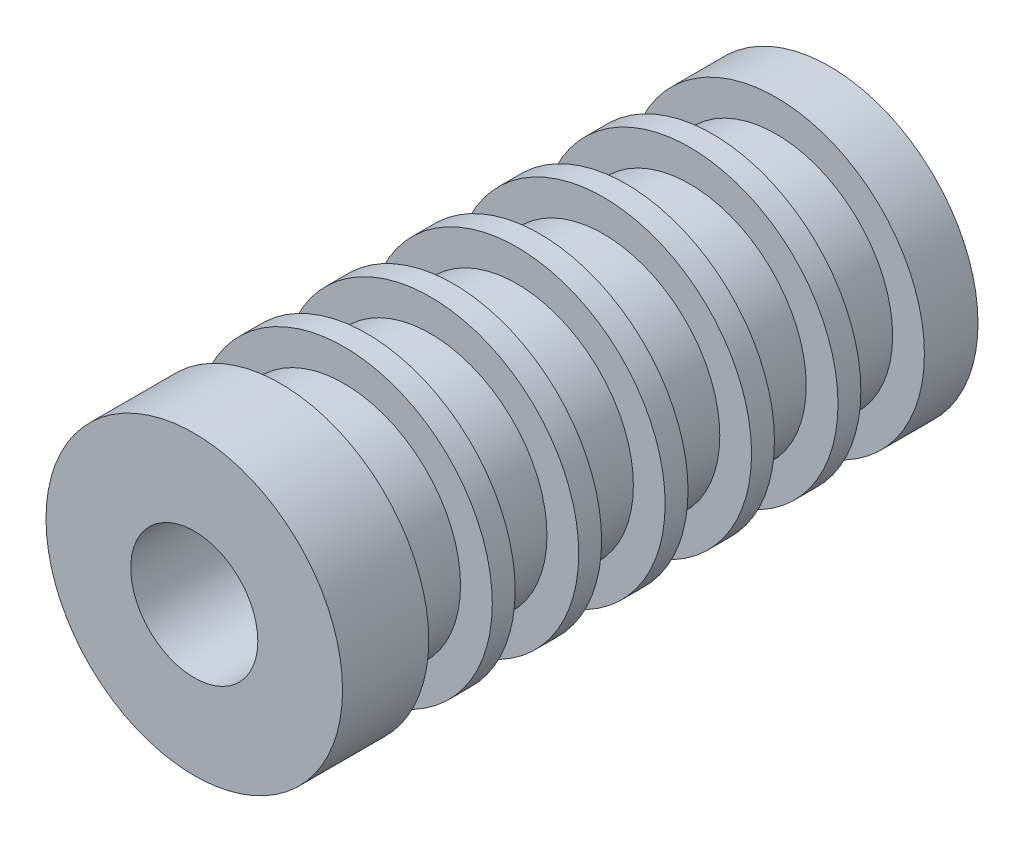
ISO-10303-21;
HEADER;
FILE_DESCRIPTION(('STEP AP214'),'2;1');
FILE_NAME('part.step','',(''),(''),'','','');
FILE_SCHEMA(('AUTOMOTIVE_DESIGN { 1 0 10303 214 1 1 1 1 }'));
ENDSEC;
DATA;
#1=APPLICATION_CONTEXT('core data for automotive mechanical design processes');
#2=APPLICATION_PROTOCOL_DEFINITION('international standard','automotive_design',2000,#1);
#3=PRODUCT_CONTEXT('',#1,'mechanical');
#4=PRODUCT('Part','Part','',(#3));
#5=PRODUCT_RELATED_PRODUCT_CATEGORY('part','',(#4));
#6=PRODUCT_DEFINITION_FORMATION('','',#4);
#7=PRODUCT_DEFINITION_CONTEXT('part definition',#1,'design');
#8=PRODUCT_DEFINITION('design','',#6,#7);
#9=PRODUCT_DEFINITION_SHAPE('','',#8);
#10=(LENGTH_UNIT() NAMED_UNIT(*) SI_UNIT(.MILLI.,.METRE.));
#11=(NAMED_UNIT(*) PLANE_ANGLE_UNIT() SI_UNIT($,.RADIAN.));
#12=(NAMED_UNIT(*) SI_UNIT($,.STERADIAN.) SOLID_ANGLE_UNIT());
#13=UNCERTAINTY_MEASURE_WITH_UNIT(LENGTH_MEASURE(1.E-05),#10,'distance_accuracy_value','');
#14=(GEOMETRIC_REPRESENTATION_CONTEXT(3) GLOBAL_UNCERTAINTY_ASSIGNED_CONTEXT((#13)) GLOBAL_UNIT_ASSIGNED_CONTEXT((#10,
#11,#12)) REPRESENTATION_CONTEXT('',''));
#15=CARTESIAN_POINT('',(0.,0.,0.));
#16=DIRECTION('',(0.,0.,1.));
#17=DIRECTION('',(1.,0.,0.));
#18=AXIS2_PLACEMENT_3D('',#15,#16,#17);
#19=CARTESIAN_POINT('',(0.,0.,25.4));
#20=DIRECTION('',(0.,0.,-1.));
#21=DIRECTION('',(-1.,0.,0.));
#22=AXIS2_PLACEMENT_3D('',#19,#20,#21);
#23=CYLINDRICAL_SURFACE('',#22,11.1125);
#24=CARTESIAN_POINT('',(0.,0.,22.225));
#25=DIRECTION('',(0.,0.,1.));
#26=DIRECTION('',(1.,0.,0.));
#27=AXIS2_PLACEMENT_3D('',#24,#25,#26);
#28=CIRCLE('',#27,11.1125);
#29=CARTESIAN_POINT('',(11.1125,0.,22.225));
#30=VERTEX_POINT('',#29);
#31=EDGE_CURVE('E39',#30,#30,#28,.T.);
#32=ORIENTED_EDGE('',*,*,#31,.F.);
#33=EDGE_LOOP('',(#32));
#34=FACE_BOUND('',#33,.T.);
#35=CARTESIAN_POINT('',(0.,0.,15.763875));
#36=DIRECTION('',(0.,0.,-1.));
#37=DIRECTION('',(-1.,0.,0.));
#38=AXIS2_PLACEMENT_3D('',#35,#36,#37);
#39=CIRCLE('',#38,11.1125);
#40=CARTESIAN_POINT('',(-11.1125,0.,15.763875));
#41=VERTEX_POINT('',#40);
#42=EDGE_CURVE('E68',#41,#41,#39,.T.);
#43=ORIENTED_EDGE('',*,*,#42,.F.);
#44=EDGE_LOOP('',(#43));
#45=FACE_BOUND('',#44,.T.);
#46=ADVANCED_FACE('F32',(#34,#45),#23,.T.);
#47=CARTESIAN_POINT('',(0.,0.,-14.906625));
#48=DIRECTION('',(0.,0.,-1.));
#49=DIRECTION('',(-1.,0.,0.));
#50=AXIS2_PLACEMENT_3D('',#47,#48,#49);
#51=CIRCLE('',#50,11.1125);
#52=CARTESIAN_POINT('',(-11.1125,0.,-14.906625));
#53=VERTEX_POINT('',#52);
#54=EDGE_CURVE('E114',#53,#53,#51,.T.);
#55=ORIENTED_EDGE('',*,*,#54,.T.);
#56=EDGE_LOOP('',(#55));
#57=FACE_BOUND('',#56,.T.);
#58=CARTESIAN_POINT('',(0.,0.,-16.621125));
#59=DIRECTION('',(0.,0.,-1.));
#60=DIRECTION('',(-1.,0.,0.));
#61=AXIS2_PLACEMENT_3D('',#58,#59,#60);
#62=CIRCLE('',#61,11.1125);
#63=CARTESIAN_POINT('',(-11.1125,0.,-16.621125));
#64=VERTEX_POINT('',#63);
#65=EDGE_CURVE('E51',#64,#64,#62,.T.);
#66=ORIENTED_EDGE('',*,*,#65,.F.);
#67=EDGE_LOOP('',(#66));
#68=FACE_BOUND('',#67,.T.);
#69=ADVANCED_FACE('F158',(#57,#68),#23,.T.);
#70=CARTESIAN_POINT('',(0.,0.,-21.383625));
#71=DIRECTION('',(0.,0.,-1.));
#72=DIRECTION('',(-1.,0.,0.));
#73=AXIS2_PLACEMENT_3D('',#70,#71,#72);
#74=CIRCLE('',#73,11.1125);
#75=CARTESIAN_POINT('',(-11.1125,0.,-21.383625));
#76=VERTEX_POINT('',#75);
#77=EDGE_CURVE('E53',#76,#76,#74,.T.);
#78=ORIENTED_EDGE('',*,*,#77,.T.);
#79=EDGE_LOOP('',(#78));
#80=FACE_BOUND('',#79,.T.);
#81=CARTESIAN_POINT('',(0.,0.,-25.4));
#82=DIRECTION('',(0.,0.,1.));
#83=DIRECTION('',(1.,0.,0.));
#84=AXIS2_PLACEMENT_3D('',#81,#82,#83);
#85=CIRCLE('',#84,11.1125);
#86=CARTESIAN_POINT('',(11.1125,0.,-25.4));
#87=VERTEX_POINT('',#86);
#88=EDGE_CURVE('E10',#87,#87,#85,.T.);
#89=ORIENTED_EDGE('',*,*,#88,.T.);
#90=EDGE_LOOP('',(#89));
#91=FACE_BOUND('',#90,.T.);
#92=ADVANCED_FACE('F34',(#80,#91),#23,.T.);
#93=CARTESIAN_POINT('',(0.,0.,-25.4));
#94=DIRECTION('',(0.,0.,1.));
#95=DIRECTION('',(1.,0.,0.));
#96=AXIS2_PLACEMENT_3D('',#93,#94,#95);
#97=PLANE('',#96);
#98=CARTESIAN_POINT('',(0.,0.,-25.4));
#99=DIRECTION('',(0.,0.,1.));
#100=DIRECTION('',(1.,0.,0.));
#101=AXIS2_PLACEMENT_3D('',#98,#99,#100);
#102=CIRCLE('',#101,4.7625);
#103=CARTESIAN_POINT('',(4.7625,0.,-25.4));
#104=VERTEX_POINT('',#103);
#105=EDGE_CURVE('E43',#104,#104,#102,.T.);
#106=ORIENTED_EDGE('',*,*,#105,.T.);
#107=EDGE_LOOP('',(#106));
#108=FACE_BOUND('',#107,.T.);
#109=ORIENTED_EDGE('',*,*,#88,.F.);
#110=EDGE_LOOP('',(#109));
#111=FACE_BOUND('',#110,.T.);
#112=ADVANCED_FACE('F157',(#108,#111),#97,.F.);
#113=CARTESIAN_POINT('',(0.,0.,22.225));
#114=DIRECTION('',(0.,0.,1.));
#115=DIRECTION('',(1.,0.,0.));
#116=AXIS2_PLACEMENT_3D('',#113,#114,#115);
#117=PLANE('',#116);
#118=CARTESIAN_POINT('',(0.,0.,22.225));
#119=DIRECTION('',(0.,0.,1.));
#120=DIRECTION('',(1.,0.,0.));
#121=AXIS2_PLACEMENT_3D('',#118,#119,#120);
#122=CIRCLE('',#121,4.7625);
#123=CARTESIAN_POINT('',(4.7625,0.,22.225));
#124=VERTEX_POINT('',#123);
#125=EDGE_CURVE('E47',#124,#124,#122,.T.);
#126=ORIENTED_EDGE('',*,*,#125,.F.);
#127=EDGE_LOOP('',(#126));
#128=FACE_BOUND('',#127,.T.);
#129=ORIENTED_EDGE('',*,*,#31,.T.);
#130=EDGE_LOOP('',(#129));
#131=FACE_BOUND('',#130,.T.);
#132=ADVANCED_FACE('F234',(#128,#131),#117,.T.);
#133=CARTESIAN_POINT('',(0.,0.,-25.4));
#134=DIRECTION('',(0.,0.,1.));
#135=DIRECTION('',(1.,0.,0.));
#136=AXIS2_PLACEMENT_3D('',#133,#134,#135);
#137=CYLINDRICAL_SURFACE('',#136,4.7625);
#138=ORIENTED_EDGE('',*,*,#105,.F.);
#139=EDGE_LOOP('',(#138));
#140=FACE_BOUND('',#139,.T.);
#141=ORIENTED_EDGE('',*,*,#125,.T.);
#142=EDGE_LOOP('',(#141));
#143=FACE_BOUND('',#142,.T.);
#144=ADVANCED_FACE('F227',(#140,#143),#137,.F.);
#145=CARTESIAN_POINT('',(0.,0.,-16.621125));
#146=DIRECTION('',(0.,0.,-1.));
#147=DIRECTION('',(-1.,0.,0.));
#148=AXIS2_PLACEMENT_3D('',#145,#146,#147);
#149=PLANE('',#148);
#150=CARTESIAN_POINT('',(0.,0.,-16.621125));
#151=DIRECTION('',(0.,0.,-1.));
#152=DIRECTION('',(-1.,0.,0.));
#153=AXIS2_PLACEMENT_3D('',#150,#151,#152);
#154=CIRCLE('',#153,8.73125);
#155=CARTESIAN_POINT('',(-8.73125,0.,-16.621125));
#156=VERTEX_POINT('',#155);
#157=EDGE_CURVE('E56',#156,#156,#154,.T.);
#158=ORIENTED_EDGE('',*,*,#157,.F.);
#159=EDGE_LOOP('',(#158));
#160=FACE_BOUND('',#159,.T.);
#161=ORIENTED_EDGE('',*,*,#65,.T.);
#162=EDGE_LOOP('',(#161));
#163=FACE_BOUND('',#162,.T.);
#164=ADVANCED_FACE('F224',(#160,#163),#149,.T.);
#165=CARTESIAN_POINT('',(0.,0.,-21.383625));
#166=DIRECTION('',(0.,0.,-1.));
#167=DIRECTION('',(-1.,0.,0.));
#168=AXIS2_PLACEMENT_3D('',#165,#166,#167);
#169=PLANE('',#168);
#170=CARTESIAN_POINT('',(0.,0.,-21.383625));
#171=DIRECTION('',(0.,0.,-1.));
#172=DIRECTION('',(-1.,0.,0.));
#173=AXIS2_PLACEMENT_3D('',#170,#171,#172);
#174=CIRCLE('',#173,8.73125);
#175=CARTESIAN_POINT('',(-8.73125,0.,-21.383625));
#176=VERTEX_POINT('',#175);
#177=EDGE_CURVE('E59',#176,#176,#174,.T.);
#178=ORIENTED_EDGE('',*,*,#177,.T.);
#179=EDGE_LOOP('',(#178));
#180=FACE_BOUND('',#179,.T.);
#181=ORIENTED_EDGE('',*,*,#77,.F.);
#182=EDGE_LOOP('',(#181));
#183=FACE_BOUND('',#182,.T.);
#184=ADVANCED_FACE('F222',(#180,#183),#169,.F.);
#185=CARTESIAN_POINT('',(0.,0.,-16.621125));
#186=DIRECTION('',(0.,0.,-1.));
#187=DIRECTION('',(-1.,0.,0.));
#188=AXIS2_PLACEMENT_3D('',#185,#186,#187);
#189=CYLINDRICAL_SURFACE('',#188,8.73125);
#190=ORIENTED_EDGE('',*,*,#157,.T.);
#191=EDGE_LOOP('',(#190));
#192=FACE_BOUND('',#191,.T.);
#193=ORIENTED_EDGE('',*,*,#177,.F.);
#194=EDGE_LOOP('',(#193));
#195=FACE_BOUND('',#194,.T.);
#196=ADVANCED_FACE('F215',(#192,#195),#189,.T.);
#197=CARTESIAN_POINT('',(0.,0.,15.763875));
#198=DIRECTION('',(0.,0.,-1.));
#199=DIRECTION('',(-1.,0.,0.));
#200=AXIS2_PLACEMENT_3D('',#197,#198,#199);
#201=PLANE('',#200);
#202=CARTESIAN_POINT('',(0.,0.,15.763875));
#203=DIRECTION('',(0.,0.,-1.));
#204=DIRECTION('',(-1.,0.,0.));
#205=AXIS2_PLACEMENT_3D('',#202,#203,#204);
#206=CIRCLE('',#205,8.73125);
#207=CARTESIAN_POINT('',(-8.73125,0.,15.763875));
#208=VERTEX_POINT('',#207);
#209=EDGE_CURVE('E69',#208,#208,#206,.T.);
#210=ORIENTED_EDGE('',*,*,#209,.F.);
#211=EDGE_LOOP('',(#210));
#212=FACE_BOUND('',#211,.T.);
#213=ORIENTED_EDGE('',*,*,#42,.T.);
#214=EDGE_LOOP('',(#213));
#215=FACE_BOUND('',#214,.T.);
#216=ADVANCED_FACE('F212',(#212,#215),#201,.T.);
#217=CARTESIAN_POINT('',(0.,0.,11.001375));
#218=DIRECTION('',(0.,0.,-1.));
#219=DIRECTION('',(-1.,0.,0.));
#220=AXIS2_PLACEMENT_3D('',#217,#218,#219);
#221=PLANE('',#220);
#222=CARTESIAN_POINT('',(0.,0.,11.001375));
#223=DIRECTION('',(0.,0.,-1.));
#224=DIRECTION('',(-1.,0.,0.));
#225=AXIS2_PLACEMENT_3D('',#222,#223,#224);
#226=CIRCLE('',#225,8.73125);
#227=CARTESIAN_POINT('',(-8.73125,0.,11.001375));
#228=VERTEX_POINT('',#227);
#229=EDGE_CURVE('E73',#228,#228,#226,.T.);
#230=ORIENTED_EDGE('',*,*,#229,.T.);
#231=EDGE_LOOP('',(#230));
#232=FACE_BOUND('',#231,.T.);
#233=CARTESIAN_POINT('',(0.,0.,11.001375));
#234=DIRECTION('',(0.,0.,-1.));
#235=DIRECTION('',(-1.,0.,0.));
#236=AXIS2_PLACEMENT_3D('',#233,#234,#235);
#237=CIRCLE('',#236,11.1125);
#238=CARTESIAN_POINT('',(-11.1125,0.,11.001375));
#239=VERTEX_POINT('',#238);
#240=EDGE_CURVE('E65',#239,#239,#237,.T.);
#241=ORIENTED_EDGE('',*,*,#240,.F.);
#242=EDGE_LOOP('',(#241));
#243=FACE_BOUND('',#242,.T.);
#244=ADVANCED_FACE('F210',(#232,#243),#221,.F.);
#245=CARTESIAN_POINT('',(0.,0.,15.763875));
#246=DIRECTION('',(0.,0.,-1.));
#247=DIRECTION('',(-1.,0.,0.));
#248=AXIS2_PLACEMENT_3D('',#245,#246,#247);
#249=CYLINDRICAL_SURFACE('',#248,8.73125);
#250=ORIENTED_EDGE('',*,*,#209,.T.);
#251=EDGE_LOOP('',(#250));
#252=FACE_BOUND('',#251,.T.);
#253=ORIENTED_EDGE('',*,*,#229,.F.);
#254=EDGE_LOOP('',(#253));
#255=FACE_BOUND('',#254,.T.);
#256=ADVANCED_FACE('F132',(#252,#255),#249,.T.);
#257=CARTESIAN_POINT('',(0.,0.,-10.144125));
#258=DIRECTION('',(0.,0.,-1.));
#259=DIRECTION('',(-1.,0.,0.));
#260=AXIS2_PLACEMENT_3D('',#257,#258,#259);
#261=PLANE('',#260);
#262=CARTESIAN_POINT('',(0.,0.,-10.144125));
#263=DIRECTION('',(0.,0.,-1.));
#264=DIRECTION('',(-1.,0.,0.));
#265=AXIS2_PLACEMENT_3D('',#262,#263,#264);
#266=CIRCLE('',#265,8.73125);
#267=CARTESIAN_POINT('',(-8.73125,0.,-10.144125));
#268=VERTEX_POINT('',#267);
#269=EDGE_CURVE('E117',#268,#268,#266,.T.);
#270=ORIENTED_EDGE('',*,*,#269,.F.);
#271=EDGE_LOOP('',(#270));
#272=FACE_BOUND('',#271,.T.);
#273=CARTESIAN_POINT('',(0.,0.,-10.144125));
#274=DIRECTION('',(0.,0.,-1.));
#275=DIRECTION('',(-1.,0.,0.));
#276=AXIS2_PLACEMENT_3D('',#273,#274,#275);
#277=CIRCLE('',#276,11.1125);
#278=CARTESIAN_POINT('',(-11.1125,0.,-10.144125));
#279=VERTEX_POINT('',#278);
#280=EDGE_CURVE('E62',#279,#279,#277,.T.);
#281=ORIENTED_EDGE('',*,*,#280,.T.);
#282=EDGE_LOOP('',(#281));
#283=FACE_BOUND('',#282,.T.);
#284=ADVANCED_FACE('F128',(#272,#283),#261,.T.);
#285=CARTESIAN_POINT('',(0.,0.,-14.906625));
#286=DIRECTION('',(0.,0.,-1.));
#287=DIRECTION('',(-1.,0.,0.));
#288=AXIS2_PLACEMENT_3D('',#285,#286,#287);
#289=PLANE('',#288);
#290=CARTESIAN_POINT('',(0.,0.,-14.906625));
#291=DIRECTION('',(0.,0.,-1.));
#292=DIRECTION('',(-1.,0.,0.));
#293=AXIS2_PLACEMENT_3D('',#290,#291,#292);
#294=CIRCLE('',#293,8.73125);
#295=CARTESIAN_POINT('',(-8.73125,0.,-14.906625));
#296=VERTEX_POINT('',#295);
#297=EDGE_CURVE('E109',#296,#296,#294,.T.);
#298=ORIENTED_EDGE('',*,*,#297,.T.);
#299=EDGE_LOOP('',(#298));
#300=FACE_BOUND('',#299,.T.);
#301=ORIENTED_EDGE('',*,*,#54,.F.);
#302=EDGE_LOOP('',(#301));
#303=FACE_BOUND('',#302,.T.);
#304=ADVANCED_FACE('F131',(#300,#303),#289,.F.);
#305=CARTESIAN_POINT('',(0.,0.,-10.144125));
#306=DIRECTION('',(0.,0.,-1.));
#307=DIRECTION('',(-1.,0.,0.));
#308=AXIS2_PLACEMENT_3D('',#305,#306,#307);
#309=CYLINDRICAL_SURFACE('',#308,8.73125);
#310=ORIENTED_EDGE('',*,*,#269,.T.);
#311=EDGE_LOOP('',(#310));
#312=FACE_BOUND('',#311,.T.);
#313=ORIENTED_EDGE('',*,*,#297,.F.);
#314=EDGE_LOOP('',(#313));
#315=FACE_BOUND('',#314,.T.);
#316=ADVANCED_FACE('F125',(#312,#315),#309,.T.);
#317=ORIENTED_EDGE('',*,*,#240,.T.);
#318=EDGE_LOOP('',(#317));
#319=FACE_BOUND('',#318,.T.);
#320=CARTESIAN_POINT('',(0.,0.,9.286875));
#321=DIRECTION('',(0.,0.,-1.));
#322=DIRECTION('',(-1.,0.,0.));
#323=AXIS2_PLACEMENT_3D('',#320,#321,#322);
#324=CIRCLE('',#323,11.1125);
#325=CARTESIAN_POINT('',(-11.1125,0.,9.286875));
#326=VERTEX_POINT('',#325);
#327=EDGE_CURVE('E81',#326,#326,#324,.T.);
#328=ORIENTED_EDGE('',*,*,#327,.F.);
#329=EDGE_LOOP('',(#328));
#330=FACE_BOUND('',#329,.T.);
#331=ADVANCED_FACE('F162',(#319,#330),#23,.T.);
#332=CARTESIAN_POINT('',(0.,0.,9.286875));
#333=DIRECTION('',(0.,0.,-1.));
#334=DIRECTION('',(-1.,0.,0.));
#335=AXIS2_PLACEMENT_3D('',#332,#333,#334);
#336=PLANE('',#335);
#337=CARTESIAN_POINT('',(0.,0.,9.286875));
#338=DIRECTION('',(0.,0.,-1.));
#339=DIRECTION('',(-1.,0.,0.));
#340=AXIS2_PLACEMENT_3D('',#337,#338,#339);
#341=CIRCLE('',#340,8.73125);
#342=CARTESIAN_POINT('',(-8.73125,0.,9.286875));
#343=VERTEX_POINT('',#342);
#344=EDGE_CURVE('E82',#343,#343,#341,.T.);
#345=ORIENTED_EDGE('',*,*,#344,.F.);
#346=EDGE_LOOP('',(#345));
#347=FACE_BOUND('',#346,.T.);
#348=ORIENTED_EDGE('',*,*,#327,.T.);
#349=EDGE_LOOP('',(#348));
#350=FACE_BOUND('',#349,.T.);
#351=ADVANCED_FACE('F169',(#347,#350),#336,.T.);
#352=CARTESIAN_POINT('',(0.,0.,4.524375));
#353=DIRECTION('',(0.,0.,-1.));
#354=DIRECTION('',(-1.,0.,0.));
#355=AXIS2_PLACEMENT_3D('',#352,#353,#354);
#356=PLANE('',#355);
#357=CARTESIAN_POINT('',(0.,0.,4.524375));
#358=DIRECTION('',(0.,0.,-1.));
#359=DIRECTION('',(-1.,0.,0.));
#360=AXIS2_PLACEMENT_3D('',#357,#358,#359);
#361=CIRCLE('',#360,8.73125);
#362=CARTESIAN_POINT('',(-8.73125,0.,4.524375));
#363=VERTEX_POINT('',#362);
#364=EDGE_CURVE('E72',#363,#363,#361,.T.);
#365=ORIENTED_EDGE('',*,*,#364,.T.);
#366=EDGE_LOOP('',(#365));
#367=FACE_BOUND('',#366,.T.);
#368=CARTESIAN_POINT('',(0.,0.,4.524375));
#369=DIRECTION('',(0.,0.,-1.));
#370=DIRECTION('',(-1.,0.,0.));
#371=AXIS2_PLACEMENT_3D('',#368,#369,#370);
#372=CIRCLE('',#371,11.1125);
#373=CARTESIAN_POINT('',(-11.1125,0.,4.524375));
#374=VERTEX_POINT('',#373);
#375=EDGE_CURVE('E78',#374,#374,#372,.T.);
#376=ORIENTED_EDGE('',*,*,#375,.F.);
#377=EDGE_LOOP('',(#376));
#378=FACE_BOUND('',#377,.T.);
#379=ADVANCED_FACE('F149',(#367,#378),#356,.F.);
#380=CARTESIAN_POINT('',(0.,0.,9.286875));
#381=DIRECTION('',(0.,0.,-1.));
#382=DIRECTION('',(-1.,0.,0.));
#383=AXIS2_PLACEMENT_3D('',#380,#381,#382);
#384=CYLINDRICAL_SURFACE('',#383,8.73125);
#385=ORIENTED_EDGE('',*,*,#344,.T.);
#386=EDGE_LOOP('',(#385));
#387=FACE_BOUND('',#386,.T.);
#388=ORIENTED_EDGE('',*,*,#364,.F.);
#389=EDGE_LOOP('',(#388));
#390=FACE_BOUND('',#389,.T.);
#391=ADVANCED_FACE('F139',(#387,#390),#384,.T.);
#392=CARTESIAN_POINT('',(0.,0.,-8.429625));
#393=DIRECTION('',(0.,0.,-1.));
#394=DIRECTION('',(-1.,0.,0.));
#395=AXIS2_PLACEMENT_3D('',#392,#393,#394);
#396=CIRCLE('',#395,11.1125);
#397=CARTESIAN_POINT('',(-11.1125,0.,-8.429625));
#398=VERTEX_POINT('',#397);
#399=EDGE_CURVE('E102',#398,#398,#396,.T.);
#400=ORIENTED_EDGE('',*,*,#399,.T.);
#401=EDGE_LOOP('',(#400));
#402=FACE_BOUND('',#401,.T.);
#403=ORIENTED_EDGE('',*,*,#280,.F.);
#404=EDGE_LOOP('',(#403));
#405=FACE_BOUND('',#404,.T.);
#406=ADVANCED_FACE('F136',(#402,#405),#23,.T.);
#407=CARTESIAN_POINT('',(0.,0.,-3.667125));
#408=DIRECTION('',(0.,0.,-1.));
#409=DIRECTION('',(-1.,0.,0.));
#410=AXIS2_PLACEMENT_3D('',#407,#408,#409);
#411=PLANE('',#410);
#412=CARTESIAN_POINT('',(0.,0.,-3.667125));
#413=DIRECTION('',(0.,0.,-1.));
#414=DIRECTION('',(-1.,0.,0.));
#415=AXIS2_PLACEMENT_3D('',#412,#413,#414);
#416=CIRCLE('',#415,8.73125);
#417=CARTESIAN_POINT('',(-8.73125,0.,-3.667125));
#418=VERTEX_POINT('',#417);
#419=EDGE_CURVE('E106',#418,#418,#416,.T.);
#420=ORIENTED_EDGE('',*,*,#419,.F.);
#421=EDGE_LOOP('',(#420));
#422=FACE_BOUND('',#421,.T.);
#423=CARTESIAN_POINT('',(0.,0.,-3.667125));
#424=DIRECTION('',(0.,0.,-1.));
#425=DIRECTION('',(-1.,0.,0.));
#426=AXIS2_PLACEMENT_3D('',#423,#424,#425);
#427=CIRCLE('',#426,11.1125);
#428=CARTESIAN_POINT('',(-11.1125,0.,-3.667125));
#429=VERTEX_POINT('',#428);
#430=EDGE_CURVE('E105',#429,#429,#427,.T.);
#431=ORIENTED_EDGE('',*,*,#430,.T.);
#432=EDGE_LOOP('',(#431));
#433=FACE_BOUND('',#432,.T.);
#434=ADVANCED_FACE('F138',(#422,#433),#411,.T.);
#435=CARTESIAN_POINT('',(0.,0.,-8.429625));
#436=DIRECTION('',(0.,0.,-1.));
#437=DIRECTION('',(-1.,0.,0.));
#438=AXIS2_PLACEMENT_3D('',#435,#436,#437);
#439=PLANE('',#438);
#440=CARTESIAN_POINT('',(0.,0.,-8.429625));
#441=DIRECTION('',(0.,0.,-1.));
#442=DIRECTION('',(-1.,0.,0.));
#443=AXIS2_PLACEMENT_3D('',#440,#441,#442);
#444=CIRCLE('',#443,8.73125);
#445=CARTESIAN_POINT('',(-8.73125,0.,-8.429625));
#446=VERTEX_POINT('',#445);
#447=EDGE_CURVE('E97',#446,#446,#444,.T.);
#448=ORIENTED_EDGE('',*,*,#447,.T.);
#449=EDGE_LOOP('',(#448));
#450=FACE_BOUND('',#449,.T.);
#451=ORIENTED_EDGE('',*,*,#399,.F.);
#452=EDGE_LOOP('',(#451));
#453=FACE_BOUND('',#452,.T.);
#454=ADVANCED_FACE('F146',(#450,#453),#439,.F.);
#455=CARTESIAN_POINT('',(0.,0.,-3.667125));
#456=DIRECTION('',(0.,0.,-1.));
#457=DIRECTION('',(-1.,0.,0.));
#458=AXIS2_PLACEMENT_3D('',#455,#456,#457);
#459=CYLINDRICAL_SURFACE('',#458,8.73125);
#460=ORIENTED_EDGE('',*,*,#419,.T.);
#461=EDGE_LOOP('',(#460));
#462=FACE_BOUND('',#461,.T.);
#463=ORIENTED_EDGE('',*,*,#447,.F.);
#464=EDGE_LOOP('',(#463));
#465=FACE_BOUND('',#464,.T.);
#466=ADVANCED_FACE('F180',(#462,#465),#459,.T.);
#467=ORIENTED_EDGE('',*,*,#375,.T.);
#468=EDGE_LOOP('',(#467));
#469=FACE_BOUND('',#468,.T.);
#470=CARTESIAN_POINT('',(0.,0.,2.809875));
#471=DIRECTION('',(0.,0.,-1.));
#472=DIRECTION('',(-1.,0.,0.));
#473=AXIS2_PLACEMENT_3D('',#470,#471,#472);
#474=CIRCLE('',#473,11.1125);
#475=CARTESIAN_POINT('',(-11.1125,0.,2.809875));
#476=VERTEX_POINT('',#475);
#477=EDGE_CURVE('E93',#476,#476,#474,.T.);
#478=ORIENTED_EDGE('',*,*,#477,.F.);
#479=EDGE_LOOP('',(#478));
#480=FACE_BOUND('',#479,.T.);
#481=ADVANCED_FACE('F154',(#469,#480),#23,.T.);
#482=CARTESIAN_POINT('',(0.,0.,-1.952625));
#483=DIRECTION('',(0.,0.,-1.));
#484=DIRECTION('',(-1.,0.,0.));
#485=AXIS2_PLACEMENT_3D('',#482,#483,#484);
#486=CIRCLE('',#485,11.1125);
#487=CARTESIAN_POINT('',(-11.1125,0.,-1.952625));
#488=VERTEX_POINT('',#487);
#489=EDGE_CURVE('E90',#488,#488,#486,.T.);
#490=ORIENTED_EDGE('',*,*,#489,.T.);
#491=EDGE_LOOP('',(#490));
#492=FACE_BOUND('',#491,.T.);
#493=ORIENTED_EDGE('',*,*,#430,.F.);
#494=EDGE_LOOP('',(#493));
#495=FACE_BOUND('',#494,.T.);
#496=ADVANCED_FACE('F141',(#492,#495),#23,.T.);
#497=CARTESIAN_POINT('',(0.,0.,2.809875));
#498=DIRECTION('',(0.,0.,-1.));
#499=DIRECTION('',(-1.,0.,0.));
#500=AXIS2_PLACEMENT_3D('',#497,#498,#499);
#501=PLANE('',#500);
#502=CARTESIAN_POINT('',(0.,0.,2.809875));
#503=DIRECTION('',(0.,0.,-1.));
#504=DIRECTION('',(-1.,0.,0.));
#505=AXIS2_PLACEMENT_3D('',#502,#503,#504);
#506=CIRCLE('',#505,8.73125);
#507=CARTESIAN_POINT('',(-8.73125,0.,2.809875));
#508=VERTEX_POINT('',#507);
#509=EDGE_CURVE('E94',#508,#508,#506,.T.);
#510=ORIENTED_EDGE('',*,*,#509,.F.);
#511=EDGE_LOOP('',(#510));
#512=FACE_BOUND('',#511,.T.);
#513=ORIENTED_EDGE('',*,*,#477,.T.);
#514=EDGE_LOOP('',(#513));
#515=FACE_BOUND('',#514,.T.);
#516=ADVANCED_FACE('F153',(#512,#515),#501,.T.);
#517=CARTESIAN_POINT('',(0.,0.,-1.952625));
#518=DIRECTION('',(0.,0.,-1.));
#519=DIRECTION('',(-1.,0.,0.));
#520=AXIS2_PLACEMENT_3D('',#517,#518,#519);
#521=PLANE('',#520);
#522=CARTESIAN_POINT('',(0.,0.,-1.952625));
#523=DIRECTION('',(0.,0.,-1.));
#524=DIRECTION('',(-1.,0.,0.));
#525=AXIS2_PLACEMENT_3D('',#522,#523,#524);
#526=CIRCLE('',#525,8.73125);
#527=CARTESIAN_POINT('',(-8.73125,0.,-1.952625));
#528=VERTEX_POINT('',#527);
#529=EDGE_CURVE('E85',#528,#528,#526,.T.);
#530=ORIENTED_EDGE('',*,*,#529,.T.);
#531=EDGE_LOOP('',(#530));
#532=FACE_BOUND('',#531,.T.);
#533=ORIENTED_EDGE('',*,*,#489,.F.);
#534=EDGE_LOOP('',(#533));
#535=FACE_BOUND('',#534,.T.);
#536=ADVANCED_FACE('F192',(#532,#535),#521,.F.);
#537=CARTESIAN_POINT('',(0.,0.,2.809875));
#538=DIRECTION('',(0.,0.,-1.));
#539=DIRECTION('',(-1.,0.,0.));
#540=AXIS2_PLACEMENT_3D('',#537,#538,#539);
#541=CYLINDRICAL_SURFACE('',#540,8.73125);
#542=ORIENTED_EDGE('',*,*,#509,.T.);
#543=EDGE_LOOP('',(#542));
#544=FACE_BOUND('',#543,.T.);
#545=ORIENTED_EDGE('',*,*,#529,.F.);
#546=EDGE_LOOP('',(#545));
#547=FACE_BOUND('',#546,.T.);
#548=ADVANCED_FACE('F198',(#544,#547),#541,.T.);
#549=CLOSED_SHELL('',(#46,#69,#92,#112,#132,#144,#164,#184,#196,#216,#244,#256,#284,#304,#316,
#331,#351,#379,#391,#406,#434,#454,#466,#481,#496,#516,#536,#548));
#550=MANIFOLD_SOLID_BREP('B2',#549);
#551=ADVANCED_BREP_SHAPE_REPRESENTATION('',(#18,#550),#14);
#552=SHAPE_DEFINITION_REPRESENTATION(#9,#551);
ENDSEC;
END-ISO-10303-21;
